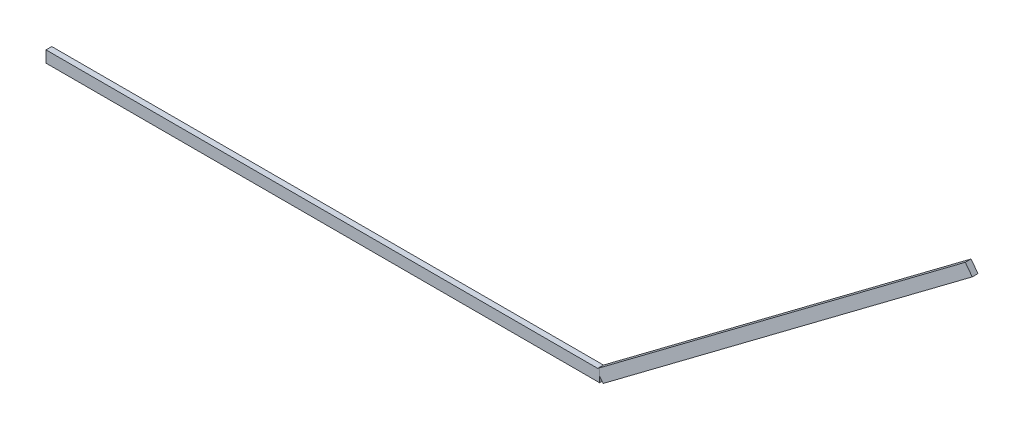
ISO-10303-21;
HEADER;
FILE_DESCRIPTION(('STEP AP214'),'2;1');
FILE_NAME('part.step','',(''),(''),'','','');
FILE_SCHEMA(('AUTOMOTIVE_DESIGN { 1 0 10303 214 1 1 1 1 }'));
ENDSEC;
DATA;
#1=APPLICATION_CONTEXT('core data for automotive mechanical design processes');
#2=APPLICATION_PROTOCOL_DEFINITION('international standard','automotive_design',2000,#1);
#3=PRODUCT_CONTEXT('',#1,'mechanical');
#4=PRODUCT('Part','Part','',(#3));
#5=PRODUCT_RELATED_PRODUCT_CATEGORY('part','',(#4));
#6=PRODUCT_DEFINITION_FORMATION('','',#4);
#7=PRODUCT_DEFINITION_CONTEXT('part definition',#1,'design');
#8=PRODUCT_DEFINITION('design','',#6,#7);
#9=PRODUCT_DEFINITION_SHAPE('','',#8);
#10=(LENGTH_UNIT() NAMED_UNIT(*) SI_UNIT(.MILLI.,.METRE.));
#11=(NAMED_UNIT(*) PLANE_ANGLE_UNIT() SI_UNIT($,.RADIAN.));
#12=(NAMED_UNIT(*) SI_UNIT($,.STERADIAN.) SOLID_ANGLE_UNIT());
#13=UNCERTAINTY_MEASURE_WITH_UNIT(LENGTH_MEASURE(1.E-05),#10,'distance_accuracy_value','');
#14=(GEOMETRIC_REPRESENTATION_CONTEXT(3) GLOBAL_UNCERTAINTY_ASSIGNED_CONTEXT((#13)) GLOBAL_UNIT_ASSIGNED_CONTEXT((#10,
#11,#12)) REPRESENTATION_CONTEXT('',''));
#15=CARTESIAN_POINT('',(0.,0.,0.));
#16=DIRECTION('',(0.,0.,1.));
#17=DIRECTION('',(1.,0.,0.));
#18=AXIS2_PLACEMENT_3D('',#15,#16,#17);
#19=CARTESIAN_POINT('',(3036.57,929.64,9.52500000000007));
#20=DIRECTION('',(0.,0.,-1.));
#21=DIRECTION('',(0.,1.,0.));
#22=AXIS2_PLACEMENT_3D('',#19,#20,#21);
#23=PLANE('',#22);
#24=DIRECTION('',(0.6,-0.8,0.));
#25=VECTOR('',#24,1.);
#26=CARTESIAN_POINT('',(1817.37,15.24,9.52500000000007));
#27=LINE('',#26,#25);
#28=CARTESIAN_POINT('',(1817.37,15.24,9.52500000000007));
#29=VERTEX_POINT('',#28);
#30=CARTESIAN_POINT('',(1840.23,-15.24,9.52499999999994));
#31=VERTEX_POINT('',#30);
#32=EDGE_CURVE('E134',#29,#31,#27,.T.);
#33=ORIENTED_EDGE('',*,*,#32,.T.);
#34=DIRECTION('',(-0.8,-0.6,0.));
#35=VECTOR('',#34,1.);
#36=CARTESIAN_POINT('',(3059.43,899.16,9.52499999999994));
#37=LINE('',#36,#35);
#38=CARTESIAN_POINT('',(3059.43,899.16,9.52499999999994));
#39=VERTEX_POINT('',#38);
#40=EDGE_CURVE('E13',#39,#31,#37,.T.);
#41=ORIENTED_EDGE('',*,*,#40,.F.);
#42=DIRECTION('',(0.6,-0.8,0.));
#43=VECTOR('',#42,1.);
#44=CARTESIAN_POINT('',(3036.57,929.64,9.52500000000007));
#45=LINE('',#44,#43);
#46=CARTESIAN_POINT('',(3036.57,929.64,9.52500000000007));
#47=VERTEX_POINT('',#46);
#48=EDGE_CURVE('E122',#47,#39,#45,.T.);
#49=ORIENTED_EDGE('',*,*,#48,.F.);
#50=DIRECTION('',(-0.8,-0.6,0.));
#51=VECTOR('',#50,1.);
#52=CARTESIAN_POINT('',(3036.57,929.64,9.52500000000007));
#53=LINE('',#52,#51);
#54=EDGE_CURVE('E130',#47,#29,#53,.T.);
#55=ORIENTED_EDGE('',*,*,#54,.T.);
#56=EDGE_LOOP('',(#33,#41,#49,#55));
#57=FACE_BOUND('',#56,.T.);
#58=ADVANCED_FACE('F71',(#57),#23,.F.);
#59=CARTESIAN_POINT('',(3059.43,899.16,-9.52500000000006));
#60=DIRECTION('',(-0.6,0.8,0.));
#61=DIRECTION('',(-0.8,-0.6,0.));
#62=AXIS2_PLACEMENT_3D('',#59,#60,#61);
#63=PLANE('',#62);
#64=DIRECTION('',(0.,0.,-1.));
#65=VECTOR('',#64,1.);
#66=CARTESIAN_POINT('',(1840.23,-15.24,-9.52500000000006));
#67=LINE('',#66,#65);
#68=CARTESIAN_POINT('',(1840.23,-15.24,-9.52500000000006));
#69=VERTEX_POINT('',#68);
#70=EDGE_CURVE('E126',#31,#69,#67,.T.);
#71=ORIENTED_EDGE('',*,*,#70,.T.);
#72=DIRECTION('',(-0.8,-0.6,0.));
#73=VECTOR('',#72,1.);
#74=CARTESIAN_POINT('',(3059.43,899.16,-9.52500000000006));
#75=LINE('',#74,#73);
#76=CARTESIAN_POINT('',(3059.43,899.16,-9.52500000000006));
#77=VERTEX_POINT('',#76);
#78=EDGE_CURVE('E79',#77,#69,#75,.T.);
#79=ORIENTED_EDGE('',*,*,#78,.F.);
#80=DIRECTION('',(0.,0.,-1.));
#81=VECTOR('',#80,1.);
#82=CARTESIAN_POINT('',(3059.43,899.16,-9.52500000000006));
#83=LINE('',#82,#81);
#84=EDGE_CURVE('E117',#39,#77,#83,.T.);
#85=ORIENTED_EDGE('',*,*,#84,.F.);
#86=ORIENTED_EDGE('',*,*,#40,.T.);
#87=EDGE_LOOP('',(#71,#79,#85,#86));
#88=FACE_BOUND('',#87,.T.);
#89=ADVANCED_FACE('F125',(#88),#63,.F.);
#90=CARTESIAN_POINT('',(3036.57,929.64,-9.52499999999993));
#91=DIRECTION('',(0.,0.,1.));
#92=DIRECTION('',(0.,-1.,0.));
#93=AXIS2_PLACEMENT_3D('',#90,#91,#92);
#94=PLANE('',#93);
#95=DIRECTION('',(-0.6,0.8,0.));
#96=VECTOR('',#95,1.);
#97=CARTESIAN_POINT('',(1817.37,15.24,-9.52499999999993));
#98=LINE('',#97,#96);
#99=CARTESIAN_POINT('',(1817.37,15.24,-9.52499999999993));
#100=VERTEX_POINT('',#99);
#101=EDGE_CURVE('E104',#69,#100,#98,.T.);
#102=ORIENTED_EDGE('',*,*,#101,.T.);
#103=DIRECTION('',(-0.8,-0.6,0.));
#104=VECTOR('',#103,1.);
#105=CARTESIAN_POINT('',(3036.57,929.64,-9.52499999999993));
#106=LINE('',#105,#104);
#107=CARTESIAN_POINT('',(3036.57,929.64,-9.52499999999993));
#108=VERTEX_POINT('',#107);
#109=EDGE_CURVE('E127',#108,#100,#106,.T.);
#110=ORIENTED_EDGE('',*,*,#109,.F.);
#111=DIRECTION('',(-0.6,0.8,0.));
#112=VECTOR('',#111,1.);
#113=CARTESIAN_POINT('',(3036.57,929.64,-9.52499999999993));
#114=LINE('',#113,#112);
#115=EDGE_CURVE('E120',#77,#108,#114,.T.);
#116=ORIENTED_EDGE('',*,*,#115,.F.);
#117=ORIENTED_EDGE('',*,*,#78,.T.);
#118=EDGE_LOOP('',(#102,#110,#116,#117));
#119=FACE_BOUND('',#118,.T.);
#120=ADVANCED_FACE('F128',(#119),#94,.F.);
#121=CARTESIAN_POINT('',(3036.57,929.64,-9.52499999999993));
#122=DIRECTION('',(0.6,-0.8,0.));
#123=DIRECTION('',(0.8,0.6,0.));
#124=AXIS2_PLACEMENT_3D('',#121,#122,#123);
#125=PLANE('',#124);
#126=DIRECTION('',(0.,0.,1.));
#127=VECTOR('',#126,1.);
#128=CARTESIAN_POINT('',(1817.37,15.24,-9.52499999999993));
#129=LINE('',#128,#127);
#130=EDGE_CURVE('E110',#100,#29,#129,.T.);
#131=ORIENTED_EDGE('',*,*,#130,.T.);
#132=ORIENTED_EDGE('',*,*,#54,.F.);
#133=DIRECTION('',(0.,0.,1.));
#134=VECTOR('',#133,1.);
#135=CARTESIAN_POINT('',(3036.57,929.64,-9.52499999999993));
#136=LINE('',#135,#134);
#137=EDGE_CURVE('E87',#108,#47,#136,.T.);
#138=ORIENTED_EDGE('',*,*,#137,.F.);
#139=ORIENTED_EDGE('',*,*,#109,.T.);
#140=EDGE_LOOP('',(#131,#132,#138,#139));
#141=FACE_BOUND('',#140,.T.);
#142=ADVANCED_FACE('F141',(#141),#125,.F.);
#143=CARTESIAN_POINT('',(3048.,914.4,0.));
#144=DIRECTION('',(-0.8,-0.6,0.));
#145=DIRECTION('',(0.,0.,1.));
#146=AXIS2_PLACEMENT_3D('',#143,#144,#145);
#147=PLANE('',#146);
#148=ORIENTED_EDGE('',*,*,#48,.T.);
#149=ORIENTED_EDGE('',*,*,#84,.T.);
#150=ORIENTED_EDGE('',*,*,#115,.T.);
#151=ORIENTED_EDGE('',*,*,#137,.T.);
#152=EDGE_LOOP('',(#148,#149,#150,#151));
#153=FACE_BOUND('',#152,.T.);
#154=ADVANCED_FACE('F118',(#153),#147,.F.);
#155=CARTESIAN_POINT('',(1828.8,0.,0.));
#156=DIRECTION('',(-0.8,-0.6,0.));
#157=DIRECTION('',(0.,0.,1.));
#158=AXIS2_PLACEMENT_3D('',#155,#156,#157);
#159=PLANE('',#158);
#160=ORIENTED_EDGE('',*,*,#32,.F.);
#161=ORIENTED_EDGE('',*,*,#130,.F.);
#162=ORIENTED_EDGE('',*,*,#101,.F.);
#163=ORIENTED_EDGE('',*,*,#70,.F.);
#164=EDGE_LOOP('',(#160,#161,#162,#163));
#165=FACE_BOUND('',#164,.T.);
#166=ADVANCED_FACE('F144',(#165),#159,.T.);
#167=CLOSED_SHELL('',(#58,#89,#120,#142,#154,#166));
#168=MANIFOLD_SOLID_BREP('B2',#167);
#169=CARTESIAN_POINT('',(1828.8,19.05,9.52500000000007));
#170=DIRECTION('',(0.,0.,-1.));
#171=DIRECTION('',(0.,1.,0.));
#172=AXIS2_PLACEMENT_3D('',#169,#170,#171);
#173=PLANE('',#172);
#174=DIRECTION('',(0.,-1.,0.));
#175=VECTOR('',#174,1.);
#176=CARTESIAN_POINT('',(0.,19.05,9.52500000000007));
#177=LINE('',#176,#175);
#178=CARTESIAN_POINT('',(0.,19.05,9.52500000000007));
#179=VERTEX_POINT('',#178);
#180=CARTESIAN_POINT('',(0.,-19.05,9.52499999999994));
#181=VERTEX_POINT('',#180);
#182=EDGE_CURVE('E272',#179,#181,#177,.T.);
#183=ORIENTED_EDGE('',*,*,#182,.T.);
#184=DIRECTION('',(-1.,0.,0.));
#185=VECTOR('',#184,1.);
#186=CARTESIAN_POINT('',(1828.8,-19.05,9.52499999999994));
#187=LINE('',#186,#185);
#188=CARTESIAN_POINT('',(1828.8,-19.05,9.52499999999994));
#189=VERTEX_POINT('',#188);
#190=EDGE_CURVE('E69',#189,#181,#187,.T.);
#191=ORIENTED_EDGE('',*,*,#190,.F.);
#192=DIRECTION('',(0.,-1.,0.));
#193=VECTOR('',#192,1.);
#194=CARTESIAN_POINT('',(1828.8,19.05,9.52500000000007));
#195=LINE('',#194,#193);
#196=CARTESIAN_POINT('',(1828.8,19.05,9.52500000000007));
#197=VERTEX_POINT('',#196);
#198=EDGE_CURVE('E260',#197,#189,#195,.T.);
#199=ORIENTED_EDGE('',*,*,#198,.F.);
#200=DIRECTION('',(-1.,0.,0.));
#201=VECTOR('',#200,1.);
#202=CARTESIAN_POINT('',(1828.8,19.05,9.52500000000007));
#203=LINE('',#202,#201);
#204=EDGE_CURVE('E268',#197,#179,#203,.T.);
#205=ORIENTED_EDGE('',*,*,#204,.T.);
#206=EDGE_LOOP('',(#183,#191,#199,#205));
#207=FACE_BOUND('',#206,.T.);
#208=ADVANCED_FACE('F209',(#207),#173,.F.);
#209=CARTESIAN_POINT('',(1828.8,-19.05,-9.52500000000006));
#210=DIRECTION('',(0.,1.,0.));
#211=DIRECTION('',(0.,0.,1.));
#212=AXIS2_PLACEMENT_3D('',#209,#210,#211);
#213=PLANE('',#212);
#214=DIRECTION('',(0.,0.,-1.));
#215=VECTOR('',#214,1.);
#216=CARTESIAN_POINT('',(0.,-19.05,-9.52500000000006));
#217=LINE('',#216,#215);
#218=CARTESIAN_POINT('',(0.,-19.05,-9.52500000000006));
#219=VERTEX_POINT('',#218);
#220=EDGE_CURVE('E264',#181,#219,#217,.T.);
#221=ORIENTED_EDGE('',*,*,#220,.T.);
#222=DIRECTION('',(-1.,0.,0.));
#223=VECTOR('',#222,1.);
#224=CARTESIAN_POINT('',(1828.8,-19.05,-9.52500000000006));
#225=LINE('',#224,#223);
#226=CARTESIAN_POINT('',(1828.8,-19.05,-9.52500000000006));
#227=VERTEX_POINT('',#226);
#228=EDGE_CURVE('E217',#227,#219,#225,.T.);
#229=ORIENTED_EDGE('',*,*,#228,.F.);
#230=DIRECTION('',(0.,0.,-1.));
#231=VECTOR('',#230,1.);
#232=CARTESIAN_POINT('',(1828.8,-19.05,-9.52500000000006));
#233=LINE('',#232,#231);
#234=EDGE_CURVE('E255',#189,#227,#233,.T.);
#235=ORIENTED_EDGE('',*,*,#234,.F.);
#236=ORIENTED_EDGE('',*,*,#190,.T.);
#237=EDGE_LOOP('',(#221,#229,#235,#236));
#238=FACE_BOUND('',#237,.T.);
#239=ADVANCED_FACE('F263',(#238),#213,.F.);
#240=CARTESIAN_POINT('',(1828.8,19.05,-9.52499999999993));
#241=DIRECTION('',(0.,0.,1.));
#242=DIRECTION('',(0.,-1.,0.));
#243=AXIS2_PLACEMENT_3D('',#240,#241,#242);
#244=PLANE('',#243);
#245=DIRECTION('',(0.,1.,0.));
#246=VECTOR('',#245,1.);
#247=CARTESIAN_POINT('',(0.,19.05,-9.52499999999993));
#248=LINE('',#247,#246);
#249=CARTESIAN_POINT('',(0.,19.05,-9.52499999999993));
#250=VERTEX_POINT('',#249);
#251=EDGE_CURVE('E242',#219,#250,#248,.T.);
#252=ORIENTED_EDGE('',*,*,#251,.T.);
#253=DIRECTION('',(-1.,0.,0.));
#254=VECTOR('',#253,1.);
#255=CARTESIAN_POINT('',(1828.8,19.05,-9.52499999999993));
#256=LINE('',#255,#254);
#257=CARTESIAN_POINT('',(1828.8,19.05,-9.52499999999993));
#258=VERTEX_POINT('',#257);
#259=EDGE_CURVE('E265',#258,#250,#256,.T.);
#260=ORIENTED_EDGE('',*,*,#259,.F.);
#261=DIRECTION('',(0.,1.,0.));
#262=VECTOR('',#261,1.);
#263=CARTESIAN_POINT('',(1828.8,19.05,-9.52499999999993));
#264=LINE('',#263,#262);
#265=EDGE_CURVE('E258',#227,#258,#264,.T.);
#266=ORIENTED_EDGE('',*,*,#265,.F.);
#267=ORIENTED_EDGE('',*,*,#228,.T.);
#268=EDGE_LOOP('',(#252,#260,#266,#267));
#269=FACE_BOUND('',#268,.T.);
#270=ADVANCED_FACE('F266',(#269),#244,.F.);
#271=CARTESIAN_POINT('',(1828.8,19.05,-9.52499999999993));
#272=DIRECTION('',(0.,-1.,0.));
#273=DIRECTION('',(0.,0.,-1.));
#274=AXIS2_PLACEMENT_3D('',#271,#272,#273);
#275=PLANE('',#274);
#276=DIRECTION('',(0.,0.,1.));
#277=VECTOR('',#276,1.);
#278=CARTESIAN_POINT('',(0.,19.05,-9.52499999999993));
#279=LINE('',#278,#277);
#280=EDGE_CURVE('E248',#250,#179,#279,.T.);
#281=ORIENTED_EDGE('',*,*,#280,.T.);
#282=ORIENTED_EDGE('',*,*,#204,.F.);
#283=DIRECTION('',(0.,0.,1.));
#284=VECTOR('',#283,1.);
#285=CARTESIAN_POINT('',(1828.8,19.05,-9.52499999999993));
#286=LINE('',#285,#284);
#287=EDGE_CURVE('E225',#258,#197,#286,.T.);
#288=ORIENTED_EDGE('',*,*,#287,.F.);
#289=ORIENTED_EDGE('',*,*,#259,.T.);
#290=EDGE_LOOP('',(#281,#282,#288,#289));
#291=FACE_BOUND('',#290,.T.);
#292=ADVANCED_FACE('F282',(#291),#275,.F.);
#293=CARTESIAN_POINT('',(1828.8,0.,0.));
#294=DIRECTION('',(-1.,0.,0.));
#295=DIRECTION('',(0.,0.,1.));
#296=AXIS2_PLACEMENT_3D('',#293,#294,#295);
#297=PLANE('',#296);
#298=ORIENTED_EDGE('',*,*,#198,.T.);
#299=ORIENTED_EDGE('',*,*,#234,.T.);
#300=ORIENTED_EDGE('',*,*,#265,.T.);
#301=ORIENTED_EDGE('',*,*,#287,.T.);
#302=EDGE_LOOP('',(#298,#299,#300,#301));
#303=FACE_BOUND('',#302,.T.);
#304=ADVANCED_FACE('F256',(#303),#297,.F.);
#305=CARTESIAN_POINT('',(0.,0.,0.));
#306=DIRECTION('',(-1.,0.,0.));
#307=DIRECTION('',(0.,0.,1.));
#308=AXIS2_PLACEMENT_3D('',#305,#306,#307);
#309=PLANE('',#308);
#310=ORIENTED_EDGE('',*,*,#182,.F.);
#311=ORIENTED_EDGE('',*,*,#280,.F.);
#312=ORIENTED_EDGE('',*,*,#251,.F.);
#313=ORIENTED_EDGE('',*,*,#220,.F.);
#314=EDGE_LOOP('',(#310,#311,#312,#313));
#315=FACE_BOUND('',#314,.T.);
#316=ADVANCED_FACE('F285',(#315),#309,.T.);
#317=CLOSED_SHELL('',(#208,#239,#270,#292,#304,#316));
#318=MANIFOLD_SOLID_BREP('B7',#317);
#319=ADVANCED_BREP_SHAPE_REPRESENTATION('',(#18,#168,#318),#14);
#320=SHAPE_DEFINITION_REPRESENTATION(#9,#319);
ENDSEC;
END-ISO-10303-21;
